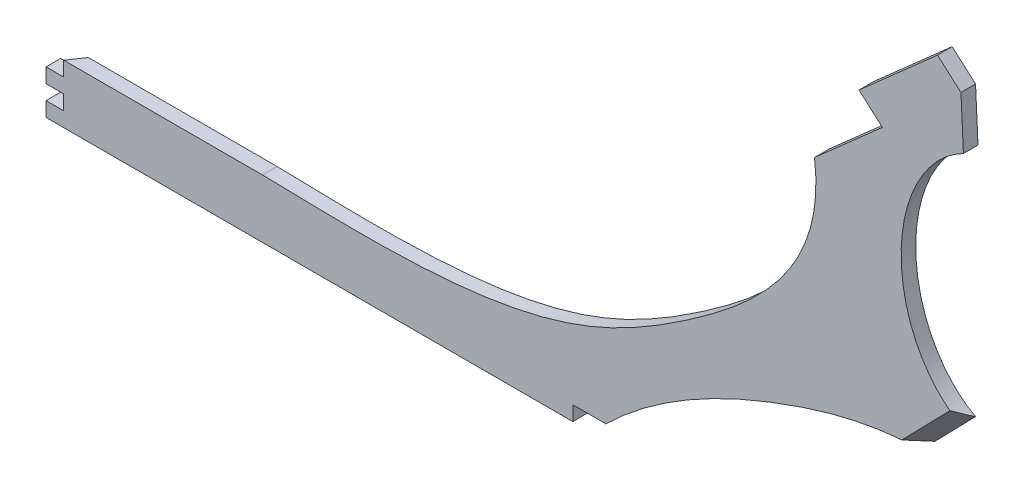
ISO-10303-21;
HEADER;
FILE_DESCRIPTION(('STEP AP214'),'2;1');
FILE_NAME('part.step','',(''),(''),'','','');
FILE_SCHEMA(('AUTOMOTIVE_DESIGN { 1 0 10303 214 1 1 1 1 }'));
ENDSEC;
DATA;
#1=APPLICATION_CONTEXT('core data for automotive mechanical design processes');
#2=APPLICATION_PROTOCOL_DEFINITION('international standard','automotive_design',2000,#1);
#3=PRODUCT_CONTEXT('',#1,'mechanical');
#4=PRODUCT('Part','Part','',(#3));
#5=PRODUCT_RELATED_PRODUCT_CATEGORY('part','',(#4));
#6=PRODUCT_DEFINITION_FORMATION('','',#4);
#7=PRODUCT_DEFINITION_CONTEXT('part definition',#1,'design');
#8=PRODUCT_DEFINITION('design','',#6,#7);
#9=PRODUCT_DEFINITION_SHAPE('','',#8);
#10=(LENGTH_UNIT() NAMED_UNIT(*) SI_UNIT(.MILLI.,.METRE.));
#11=(NAMED_UNIT(*) PLANE_ANGLE_UNIT() SI_UNIT($,.RADIAN.));
#12=(NAMED_UNIT(*) SI_UNIT($,.STERADIAN.) SOLID_ANGLE_UNIT());
#13=UNCERTAINTY_MEASURE_WITH_UNIT(LENGTH_MEASURE(1.E-05),#10,'distance_accuracy_value','');
#14=(GEOMETRIC_REPRESENTATION_CONTEXT(3) GLOBAL_UNCERTAINTY_ASSIGNED_CONTEXT((#13)) GLOBAL_UNIT_ASSIGNED_CONTEXT((#10,
#11,#12)) REPRESENTATION_CONTEXT('',''));
#15=CARTESIAN_POINT('',(0.,0.,0.));
#16=DIRECTION('',(0.,0.,1.));
#17=DIRECTION('',(1.,0.,0.));
#18=AXIS2_PLACEMENT_3D('',#15,#16,#17);
#19=CARTESIAN_POINT('',(-575.271952130616,-118.031926349393,10.));
#20=DIRECTION('',(1.,0.,0.));
#21=DIRECTION('',(0.,0.,-1.));
#22=AXIS2_PLACEMENT_3D('',#19,#20,#21);
#23=PLANE('',#22);
#24=DIRECTION('',(0.,-1.,0.));
#25=VECTOR('',#24,1.);
#26=CARTESIAN_POINT('',(-575.271952130616,-118.031926349393,10.));
#27=LINE('',#26,#25);
#28=CARTESIAN_POINT('',(-575.271952130616,-148.031926349393,10.));
#29=VERTEX_POINT('',#28);
#30=CARTESIAN_POINT('',(-575.271952130616,-158.031926349393,10.));
#31=VERTEX_POINT('',#30);
#32=EDGE_CURVE('E362',#29,#31,#27,.T.);
#33=ORIENTED_EDGE('',*,*,#32,.F.);
#34=DIRECTION('',(0.,0.,-1.));
#35=VECTOR('',#34,1.);
#36=CARTESIAN_POINT('',(-575.271952130616,-148.031926349393,10.));
#37=LINE('',#36,#35);
#38=CARTESIAN_POINT('',(-575.271952130616,-148.031926349393,0.));
#39=VERTEX_POINT('',#38);
#40=EDGE_CURVE('E11',#29,#39,#37,.T.);
#41=ORIENTED_EDGE('',*,*,#40,.T.);
#42=DIRECTION('',(0.,-1.,0.));
#43=VECTOR('',#42,1.);
#44=CARTESIAN_POINT('',(-575.271952130616,-118.031926349393,0.));
#45=LINE('',#44,#43);
#46=CARTESIAN_POINT('',(-575.271952130616,-158.031926349393,0.));
#47=VERTEX_POINT('',#46);
#48=EDGE_CURVE('E339',#39,#47,#45,.T.);
#49=ORIENTED_EDGE('',*,*,#48,.T.);
#50=DIRECTION('',(0.,0.,-1.));
#51=VECTOR('',#50,1.);
#52=CARTESIAN_POINT('',(-575.271952130616,-158.031926349393,10.));
#53=LINE('',#52,#51);
#54=EDGE_CURVE('E308',#31,#47,#53,.T.);
#55=ORIENTED_EDGE('',*,*,#54,.F.);
#56=EDGE_LOOP('',(#33,#41,#49,#55));
#57=FACE_BOUND('',#56,.T.);
#58=ADVANCED_FACE('F32',(#57),#23,.F.);
#59=CARTESIAN_POINT('',(-192.080048862351,-148.031926349393,10.));
#60=CARTESIAN_POINT('',(-157.83700898392,-114.518844889762,10.));
#61=CARTESIAN_POINT('',(-75.1684754251868,-70.6098253840643,10.));
#62=CARTESIAN_POINT('',(16.2410978910054,-49.9389353274737,10.));
#63=CARTESIAN_POINT('',(61.8185418160024,-59.5684170689204,10.));
#64=B_SPLINE_CURVE_WITH_KNOTS('',3,(#59,#60,#61,#62,#63),.UNSPECIFIED.,.F.,.F.,(4,1,4),(0.,
0.513639288530766,1.),.UNSPECIFIED.);
#65=DIRECTION('',(0.,0.,-1.));
#66=VECTOR('',#65,1.);
#67=SURFACE_OF_LINEAR_EXTRUSION('',#64,#66);
#68=CARTESIAN_POINT('',(10.4522064024743,-56.3350215880842,10.0000000000024));
#69=CARTESIAN_POINT('',(12.5898375378794,-56.1782611863151,8.36783221015587));
#70=CARTESIAN_POINT('',(14.7152933126584,-56.0555617975965,6.71841498189915));
#71=CARTESIAN_POINT('',(18.9418541409639,-55.8782850462602,3.38508164856541));
#72=CARTESIAN_POINT('',(21.0429591944905,-55.8237076836426,1.70116554348838));
#73=CARTESIAN_POINT('',(23.131888887391,-55.8031913340754,1.19348975147204E-12));
#74=B_SPLINE_CURVE_WITH_KNOTS('',3,(#68,#69,#70,#71,#72,#73),.UNSPECIFIED.,.F.,.F.,(4,2,4),(0.,
8.07952667243744,16.1590533448749),.UNSPECIFIED.);
#75=CARTESIAN_POINT('',(10.4522064024743,-56.3350215880842,10.0000000000024));
#76=VERTEX_POINT('',#75);
#77=CARTESIAN_POINT('',(23.1318888873908,-55.8031913340754,0.));
#78=VERTEX_POINT('',#77);
#79=EDGE_CURVE('E278',#76,#78,#74,.T.);
#80=ORIENTED_EDGE('',*,*,#79,.F.);
#81=CARTESIAN_POINT('',(-192.080048862351,-148.031926349393,10.));
#82=VERTEX_POINT('',#81);
#83=EDGE_CURVE('E285',#82,#76,#64,.T.);
#84=ORIENTED_EDGE('',*,*,#83,.F.);
#85=DIRECTION('',(0.,0.,-1.));
#86=VECTOR('',#85,1.);
#87=CARTESIAN_POINT('',(-192.080048862351,-148.031926349393,10.));
#88=LINE('',#87,#86);
#89=CARTESIAN_POINT('',(-192.080048862351,-148.031926349393,0.));
#90=VERTEX_POINT('',#89);
#91=EDGE_CURVE('E187',#82,#90,#88,.T.);
#92=ORIENTED_EDGE('',*,*,#91,.T.);
#93=CARTESIAN_POINT('',(-192.080048862351,-148.031926349393,0.));
#94=CARTESIAN_POINT('',(-157.83700898392,-114.518844889762,0.));
#95=CARTESIAN_POINT('',(-75.1684754251868,-70.6098253840643,0.));
#96=CARTESIAN_POINT('',(16.2410978910054,-49.9389353274737,0.));
#97=CARTESIAN_POINT('',(61.8185418160024,-59.5684170689204,0.));
#98=B_SPLINE_CURVE_WITH_KNOTS('',3,(#93,#94,#95,#96,#97),.UNSPECIFIED.,.F.,.F.,(4,1,4),(0.,
0.513639288530766,1.),.UNSPECIFIED.);
#99=EDGE_CURVE('E264',#90,#78,#98,.T.);
#100=ORIENTED_EDGE('',*,*,#99,.T.);
#101=EDGE_LOOP('',(#80,#84,#92,#100));
#102=FACE_BOUND('',#101,.T.);
#103=ADVANCED_FACE('F34',(#102),#67,.F.);
#104=CARTESIAN_POINT('',(50.9302948183221,169.898138866862,10.));
#105=DIRECTION('',(-0.998876134021714,-0.0473969290337899,0.));
#106=DIRECTION('',(0.0473969290337899,-0.998876134021714,0.));
#107=AXIS2_PLACEMENT_3D('',#104,#105,#106);
#108=PLANE('',#107);
#109=DIRECTION('',(-0.0473969290337899,0.998876134021714,0.));
#110=VECTOR('',#109,1.);
#111=CARTESIAN_POINT('',(50.9302948183221,169.898138866862,10.));
#112=LINE('',#111,#110);
#113=CARTESIAN_POINT('',(52.6080237171103,134.54050303431,10.));
#114=VERTEX_POINT('',#113);
#115=CARTESIAN_POINT('',(50.9302948183221,169.898138866862,10.));
#116=VERTEX_POINT('',#115);
#117=EDGE_CURVE('E291',#114,#116,#112,.T.);
#118=ORIENTED_EDGE('',*,*,#117,.F.);
#119=DIRECTION('',(0.,0.,1.));
#120=VECTOR('',#119,1.);
#121=CARTESIAN_POINT('',(52.6080237171103,134.54050303431,0.));
#122=LINE('',#121,#120);
#123=CARTESIAN_POINT('',(52.6080237171103,134.54050303431,0.));
#124=VERTEX_POINT('',#123);
#125=EDGE_CURVE('E239',#114,#124,#122,.F.);
#126=ORIENTED_EDGE('',*,*,#125,.T.);
#127=DIRECTION('',(-0.0473969290337899,0.998876134021714,0.));
#128=VECTOR('',#127,1.);
#129=CARTESIAN_POINT('',(50.9302948183221,169.898138866862,0.));
#130=LINE('',#129,#128);
#131=CARTESIAN_POINT('',(50.9302948183221,169.898138866862,0.));
#132=VERTEX_POINT('',#131);
#133=EDGE_CURVE('E290',#124,#132,#130,.T.);
#134=ORIENTED_EDGE('',*,*,#133,.T.);
#135=DIRECTION('',(0.,0.,-1.));
#136=VECTOR('',#135,1.);
#137=CARTESIAN_POINT('',(50.9302948183221,169.898138866862,10.));
#138=LINE('',#137,#136);
#139=EDGE_CURVE('E310',#116,#132,#138,.T.);
#140=ORIENTED_EDGE('',*,*,#139,.F.);
#141=EDGE_LOOP('',(#118,#126,#134,#140));
#142=FACE_BOUND('',#141,.T.);
#143=ADVANCED_FACE('F391',(#142),#108,.F.);
#144=CARTESIAN_POINT('',(-192.957564545317,-91.4048145856407,10.));
#145=DIRECTION('',(0.,0.,1.));
#146=DIRECTION('',(1.,0.,0.));
#147=AXIS2_PLACEMENT_3D('',#144,#145,#146);
#148=PLANE('',#147);
#149=DIRECTION('',(0.,-1.,0.));
#150=VECTOR('',#149,1.);
#151=CARTESIAN_POINT('',(-214.703789377147,-148.031926349393,10.));
#152=LINE('',#151,#150);
#153=CARTESIAN_POINT('',(-214.703789377147,-148.031926349393,10.));
#154=VERTEX_POINT('',#153);
#155=CARTESIAN_POINT('',(-214.703789377147,-158.031926349393,10.));
#156=VERTEX_POINT('',#155);
#157=EDGE_CURVE('E175',#154,#156,#152,.T.);
#158=ORIENTED_EDGE('',*,*,#157,.F.);
#159=DIRECTION('',(-1.,0.,0.));
#160=VECTOR('',#159,1.);
#161=CARTESIAN_POINT('',(-192.080048862351,-148.031926349393,10.));
#162=LINE('',#161,#160);
#163=EDGE_CURVE('E182',#82,#154,#162,.T.);
#164=ORIENTED_EDGE('',*,*,#163,.F.);
#165=ORIENTED_EDGE('',*,*,#83,.T.);
#166=DIRECTION('',(0.697503039527459,0.716581823555382,0.));
#167=VECTOR('',#166,1.);
#168=CARTESIAN_POINT('',(-106.037294759092,-176.010857300529,10.));
#169=LINE('',#168,#167);
#170=CARTESIAN_POINT('',(43.412072470478,-22.4736050885302,10.));
#171=VERTEX_POINT('',#170);
#172=EDGE_CURVE('E284',#76,#171,#169,.T.);
#173=ORIENTED_EDGE('',*,*,#172,.T.);
#174=CARTESIAN_POINT('',(76.445934184595,53.1674881884685,10.));
#175=DIRECTION('',(0.,0.,1.));
#176=DIRECTION('',(0.,-1.,0.));
#177=AXIS2_PLACEMENT_3D('',#174,#175,#176);
#178=ELLIPSE('',#177,87.1747624692816,66.4535254185836);
#179=EDGE_CURVE('E234',#114,#171,#178,.T.);
#180=ORIENTED_EDGE('',*,*,#179,.F.);
#181=ORIENTED_EDGE('',*,*,#117,.T.);
#182=DIRECTION('',(-0.749064254158382,0.662497353309542,0.));
#183=VECTOR('',#182,1.);
#184=CARTESIAN_POINT('',(50.9302948183221,169.898138866862,10.));
#185=LINE('',#184,#183);
#186=CARTESIAN_POINT('',(34.9402410916513,184.040274490593,10.));
#187=VERTEX_POINT('',#186);
#188=EDGE_CURVE('E295',#116,#187,#185,.T.);
#189=ORIENTED_EDGE('',*,*,#188,.T.);
#190=DIRECTION('',(-0.749064254158384,-0.662497353309539,0.));
#191=VECTOR('',#190,1.);
#192=CARTESIAN_POINT('',(34.9402410916513,184.040274490593,10.));
#193=LINE('',#192,#191);
#194=CARTESIAN_POINT('',(-18.8625845957431,136.455265032998,10.));
#195=VERTEX_POINT('',#194);
#196=EDGE_CURVE('E355',#187,#195,#193,.T.);
#197=ORIENTED_EDGE('',*,*,#196,.T.);
#198=DIRECTION('',(0.749064254158386,-0.662497353309537,0.));
#199=VECTOR('',#198,1.);
#200=CARTESIAN_POINT('',(-18.8625845957431,136.455265032998,10.));
#201=LINE('',#200,#199);
#202=CARTESIAN_POINT('',(-2.8725308690723,122.313129409267,10.));
#203=VERTEX_POINT('',#202);
#204=EDGE_CURVE('E353',#195,#203,#201,.T.);
#205=ORIENTED_EDGE('',*,*,#204,.T.);
#206=DIRECTION('',(-0.749064254158383,-0.66249735330954,0.));
#207=VECTOR('',#206,1.);
#208=CARTESIAN_POINT('',(-2.8725308690723,122.313129409267,10.));
#209=LINE('',#208,#207);
#210=CARTESIAN_POINT('',(-49.2705355030989,81.2771901046705,10.));
#211=VERTEX_POINT('',#210);
#212=EDGE_CURVE('E347',#203,#211,#209,.T.);
#213=ORIENTED_EDGE('',*,*,#212,.T.);
#214=CARTESIAN_POINT('',(-49.2705355030988,81.2771901046705,10.));
#215=CARTESIAN_POINT('',(-41.0571545855861,17.2026348476018,10.));
#216=CARTESIAN_POINT('',(-108.651854921098,-44.255191332768,10.));
#217=CARTESIAN_POINT('',(-244.870528991534,-125.219604065018,10.));
#218=CARTESIAN_POINT('',(-356.640288990154,-119.331018895481,10.));
#219=CARTESIAN_POINT('',(-427.107921318519,-118.031926349393,10.));
#220=B_SPLINE_CURVE_WITH_KNOTS('',3,(#214,#215,#216,#217,#218,#219),.UNSPECIFIED.,.F.,.F.,(4,1,
1,4),(0.,0.356407170334646,0.531921689294259,1.),.UNSPECIFIED.);
#221=CARTESIAN_POINT('',(-427.107921318519,-118.031926349393,10.));
#222=VERTEX_POINT('',#221);
#223=EDGE_CURVE('E352',#211,#222,#220,.T.);
#224=ORIENTED_EDGE('',*,*,#223,.T.);
#225=DIRECTION('',(-1.,0.,0.));
#226=VECTOR('',#225,1.);
#227=CARTESIAN_POINT('',(-427.107921318519,-118.031926349393,10.));
#228=LINE('',#227,#226);
#229=CARTESIAN_POINT('',(-563.157657035974,-118.031926349393,9.99999999999998));
#230=VERTEX_POINT('',#229);
#231=EDGE_CURVE('E363',#222,#230,#228,.T.);
#232=ORIENTED_EDGE('',*,*,#231,.T.);
#233=DIRECTION('',(0.,1.,0.));
#234=VECTOR('',#233,1.);
#235=CARTESIAN_POINT('',(-563.157657035974,-91.4048145856407,10.));
#236=LINE('',#235,#234);
#237=CARTESIAN_POINT('',(-563.157657035974,-128.031926349393,9.99999999999997));
#238=VERTEX_POINT('',#237);
#239=EDGE_CURVE('E232',#238,#230,#236,.T.);
#240=ORIENTED_EDGE('',*,*,#239,.F.);
#241=DIRECTION('',(1.,0.,0.));
#242=VECTOR('',#241,1.);
#243=CARTESIAN_POINT('',(-192.957564545317,-128.031926349393,10.));
#244=LINE('',#243,#242);
#245=CARTESIAN_POINT('',(-575.271952130616,-128.031926349393,10.));
#246=VERTEX_POINT('',#245);
#247=EDGE_CURVE('E230',#246,#238,#244,.T.);
#248=ORIENTED_EDGE('',*,*,#247,.F.);
#249=CARTESIAN_POINT('',(-575.271952130616,-138.031926349393,10.));
#250=VERTEX_POINT('',#249);
#251=EDGE_CURVE('E359',#246,#250,#27,.T.);
#252=ORIENTED_EDGE('',*,*,#251,.T.);
#253=DIRECTION('',(-1.,0.,0.));
#254=VECTOR('',#253,1.);
#255=CARTESIAN_POINT('',(-192.957564545317,-138.031926349393,10.));
#256=LINE('',#255,#254);
#257=CARTESIAN_POINT('',(-563.157657035974,-138.031926349393,10.));
#258=VERTEX_POINT('',#257);
#259=EDGE_CURVE('E49',#258,#250,#256,.T.);
#260=ORIENTED_EDGE('',*,*,#259,.F.);
#261=DIRECTION('',(0.,-1.,0.));
#262=VECTOR('',#261,1.);
#263=CARTESIAN_POINT('',(-563.157657035974,-91.4048145856407,10.));
#264=LINE('',#263,#262);
#265=CARTESIAN_POINT('',(-563.157657035974,-148.031926349393,10.));
#266=VERTEX_POINT('',#265);
#267=EDGE_CURVE('E218',#258,#266,#264,.T.);
#268=ORIENTED_EDGE('',*,*,#267,.T.);
#269=DIRECTION('',(1.,0.,0.));
#270=VECTOR('',#269,1.);
#271=CARTESIAN_POINT('',(-192.957564545317,-148.031926349393,10.));
#272=LINE('',#271,#270);
#273=EDGE_CURVE('E216',#29,#266,#272,.T.);
#274=ORIENTED_EDGE('',*,*,#273,.F.);
#275=ORIENTED_EDGE('',*,*,#32,.T.);
#276=DIRECTION('',(1.,0.,0.));
#277=VECTOR('',#276,1.);
#278=CARTESIAN_POINT('',(-575.271952130616,-158.031926349393,10.));
#279=LINE('',#278,#277);
#280=EDGE_CURVE('E196',#31,#156,#279,.T.);
#281=ORIENTED_EDGE('',*,*,#280,.T.);
#282=EDGE_LOOP('',(#158,#164,#165,#173,#180,#181,#189,#197,#205,#213,#224,#232,#240,#248,#252,
#260,#268,#274,#275,#281));
#283=FACE_BOUND('',#282,.T.);
#284=ADVANCED_FACE('F194',(#283),#148,.T.);
#285=CARTESIAN_POINT('',(-192.957564545317,-91.4048145856407,0.));
#286=DIRECTION('',(0.,0.,1.));
#287=DIRECTION('',(1.,0.,0.));
#288=AXIS2_PLACEMENT_3D('',#285,#286,#287);
#289=PLANE('',#288);
#290=DIRECTION('',(1.,0.,0.));
#291=VECTOR('',#290,1.);
#292=CARTESIAN_POINT('',(-214.703789377147,-148.031926349393,0.));
#293=LINE('',#292,#291);
#294=CARTESIAN_POINT('',(-214.703789377147,-148.031926349393,0.));
#295=VERTEX_POINT('',#294);
#296=EDGE_CURVE('E181',#295,#90,#293,.T.);
#297=ORIENTED_EDGE('',*,*,#296,.F.);
#298=DIRECTION('',(0.,-1.,0.));
#299=VECTOR('',#298,1.);
#300=CARTESIAN_POINT('',(-214.703789377147,-148.031926349393,0.));
#301=LINE('',#300,#299);
#302=CARTESIAN_POINT('',(-214.703789377147,-158.031926349393,0.));
#303=VERTEX_POINT('',#302);
#304=EDGE_CURVE('E178',#295,#303,#301,.T.);
#305=ORIENTED_EDGE('',*,*,#304,.T.);
#306=DIRECTION('',(1.,0.,0.));
#307=VECTOR('',#306,1.);
#308=CARTESIAN_POINT('',(-575.271952130616,-158.031926349393,0.));
#309=LINE('',#308,#307);
#310=EDGE_CURVE('E333',#47,#303,#309,.T.);
#311=ORIENTED_EDGE('',*,*,#310,.F.);
#312=ORIENTED_EDGE('',*,*,#48,.F.);
#313=DIRECTION('',(1.,0.,0.));
#314=VECTOR('',#313,1.);
#315=CARTESIAN_POINT('',(-192.957564545317,-148.031926349393,0.));
#316=LINE('',#315,#314);
#317=CARTESIAN_POINT('',(-556.319810471442,-148.031926349393,-2.22044604925031E-13));
#318=VERTEX_POINT('',#317);
#319=EDGE_CURVE('E213',#39,#318,#316,.T.);
#320=ORIENTED_EDGE('',*,*,#319,.T.);
#321=DIRECTION('',(0.,1.,0.));
#322=VECTOR('',#321,1.);
#323=CARTESIAN_POINT('',(-556.319810471442,-138.031926349393,-2.22044604925031E-13));
#324=LINE('',#323,#322);
#325=CARTESIAN_POINT('',(-556.319810471442,-138.031926349393,-2.22044604925031E-13));
#326=VERTEX_POINT('',#325);
#327=EDGE_CURVE('E198',#318,#326,#324,.T.);
#328=ORIENTED_EDGE('',*,*,#327,.T.);
#329=DIRECTION('',(-1.,0.,0.));
#330=VECTOR('',#329,1.);
#331=CARTESIAN_POINT('',(-192.957564545317,-138.031926349393,0.));
#332=LINE('',#331,#330);
#333=CARTESIAN_POINT('',(-575.271952130616,-138.031926349393,0.));
#334=VERTEX_POINT('',#333);
#335=EDGE_CURVE('E209',#326,#334,#332,.T.);
#336=ORIENTED_EDGE('',*,*,#335,.T.);
#337=CARTESIAN_POINT('',(-575.271952130616,-128.031926349393,0.));
#338=VERTEX_POINT('',#337);
#339=EDGE_CURVE('E336',#338,#334,#45,.T.);
#340=ORIENTED_EDGE('',*,*,#339,.F.);
#341=DIRECTION('',(1.,0.,0.));
#342=VECTOR('',#341,1.);
#343=CARTESIAN_POINT('',(-192.957564545317,-128.031926349393,0.));
#344=LINE('',#343,#342);
#345=CARTESIAN_POINT('',(-556.319810471442,-128.031926349393,-2.22044604925031E-13));
#346=VERTEX_POINT('',#345);
#347=EDGE_CURVE('E57',#338,#346,#344,.T.);
#348=ORIENTED_EDGE('',*,*,#347,.T.);
#349=DIRECTION('',(0.,1.,0.));
#350=VECTOR('',#349,1.);
#351=CARTESIAN_POINT('',(-556.319810471442,-118.031926349393,-2.22044604925031E-13));
#352=LINE('',#351,#350);
#353=CARTESIAN_POINT('',(-556.319810471442,-118.031926349393,-2.22044604925031E-13));
#354=VERTEX_POINT('',#353);
#355=EDGE_CURVE('E226',#346,#354,#352,.T.);
#356=ORIENTED_EDGE('',*,*,#355,.T.);
#357=DIRECTION('',(-1.,0.,0.));
#358=VECTOR('',#357,1.);
#359=CARTESIAN_POINT('',(-427.107921318519,-118.031926349393,0.));
#360=LINE('',#359,#358);
#361=CARTESIAN_POINT('',(-427.107921318519,-118.031926349393,0.));
#362=VERTEX_POINT('',#361);
#363=EDGE_CURVE('E327',#362,#354,#360,.T.);
#364=ORIENTED_EDGE('',*,*,#363,.F.);
#365=CARTESIAN_POINT('',(-49.2705355030988,81.2771901046705,0.));
#366=CARTESIAN_POINT('',(-41.0571545855861,17.2026348476018,0.));
#367=CARTESIAN_POINT('',(-108.651854921098,-44.255191332768,0.));
#368=CARTESIAN_POINT('',(-244.870528991534,-125.219604065018,0.));
#369=CARTESIAN_POINT('',(-356.640288990154,-119.331018895481,0.));
#370=CARTESIAN_POINT('',(-427.107921318519,-118.031926349393,0.));
#371=B_SPLINE_CURVE_WITH_KNOTS('',3,(#365,#366,#367,#368,#369,#370),.UNSPECIFIED.,.F.,.F.,(4,1,
1,4),(0.,0.356407170334646,0.531921689294259,1.),.UNSPECIFIED.);
#372=CARTESIAN_POINT('',(-49.2705355030989,81.2771901046705,0.));
#373=VERTEX_POINT('',#372);
#374=EDGE_CURVE('E328',#373,#362,#371,.T.);
#375=ORIENTED_EDGE('',*,*,#374,.F.);
#376=DIRECTION('',(-0.749064254158383,-0.66249735330954,0.));
#377=VECTOR('',#376,1.);
#378=CARTESIAN_POINT('',(-2.8725308690723,122.313129409267,0.));
#379=LINE('',#378,#377);
#380=CARTESIAN_POINT('',(-2.8725308690723,122.313129409267,0.));
#381=VERTEX_POINT('',#380);
#382=EDGE_CURVE('E321',#381,#373,#379,.T.);
#383=ORIENTED_EDGE('',*,*,#382,.F.);
#384=DIRECTION('',(0.749064254158386,-0.662497353309537,0.));
#385=VECTOR('',#384,1.);
#386=CARTESIAN_POINT('',(-18.8625845957431,136.455265032998,0.));
#387=LINE('',#386,#385);
#388=CARTESIAN_POINT('',(-18.8625845957431,136.455265032998,0.));
#389=VERTEX_POINT('',#388);
#390=EDGE_CURVE('E317',#389,#381,#387,.T.);
#391=ORIENTED_EDGE('',*,*,#390,.F.);
#392=DIRECTION('',(-0.749064254158384,-0.662497353309539,0.));
#393=VECTOR('',#392,1.);
#394=CARTESIAN_POINT('',(34.9402410916513,184.040274490593,0.));
#395=LINE('',#394,#393);
#396=CARTESIAN_POINT('',(34.9402410916513,184.040274490593,0.));
#397=VERTEX_POINT('',#396);
#398=EDGE_CURVE('E312',#397,#389,#395,.T.);
#399=ORIENTED_EDGE('',*,*,#398,.F.);
#400=DIRECTION('',(-0.749064254158382,0.662497353309542,0.));
#401=VECTOR('',#400,1.);
#402=CARTESIAN_POINT('',(50.9302948183221,169.898138866862,0.));
#403=LINE('',#402,#401);
#404=EDGE_CURVE('E313',#132,#397,#403,.T.);
#405=ORIENTED_EDGE('',*,*,#404,.F.);
#406=ORIENTED_EDGE('',*,*,#133,.F.);
#407=CARTESIAN_POINT('',(76.445934184595,53.1674881884685,0.));
#408=DIRECTION('',(0.,0.,1.));
#409=DIRECTION('',(0.,-1.,0.));
#410=AXIS2_PLACEMENT_3D('',#407,#408,#409);
#411=ELLIPSE('',#410,87.1747624692816,66.4535254185836);
#412=CARTESIAN_POINT('',(50.8789377366644,-27.2971781184744,0.));
#413=VERTEX_POINT('',#412);
#414=EDGE_CURVE('E235',#124,#413,#411,.T.);
#415=ORIENTED_EDGE('',*,*,#414,.T.);
#416=DIRECTION('',(0.697503039527459,0.716581823555382,0.));
#417=VECTOR('',#416,1.);
#418=CARTESIAN_POINT('',(-99.7922291487614,-182.089649843216,0.));
#419=LINE('',#418,#417);
#420=EDGE_CURVE('E263',#78,#413,#419,.T.);
#421=ORIENTED_EDGE('',*,*,#420,.F.);
#422=ORIENTED_EDGE('',*,*,#99,.F.);
#423=EDGE_LOOP('',(#297,#305,#311,#312,#320,#328,#336,#340,#348,#356,#364,#375,#383,#391,#399,
#405,#406,#415,#421,#422));
#424=FACE_BOUND('',#423,.T.);
#425=ADVANCED_FACE('F387',(#424),#289,.F.);
#426=DIRECTION('',(0.,0.,-1.));
#427=VECTOR('',#426,1.);
#428=SURFACE_OF_LINEAR_EXTRUSION('',#220,#427);
#429=ORIENTED_EDGE('',*,*,#374,.T.);
#430=DIRECTION('',(0.,0.,-1.));
#431=VECTOR('',#430,1.);
#432=CARTESIAN_POINT('',(-427.107921318519,-118.031926349393,10.));
#433=LINE('',#432,#431);
#434=EDGE_CURVE('E342',#222,#362,#433,.T.);
#435=ORIENTED_EDGE('',*,*,#434,.F.);
#436=ORIENTED_EDGE('',*,*,#223,.F.);
#437=DIRECTION('',(0.,0.,-1.));
#438=VECTOR('',#437,1.);
#439=CARTESIAN_POINT('',(-49.2705355030989,81.2771901046705,10.));
#440=LINE('',#439,#438);
#441=EDGE_CURVE('E324',#211,#373,#440,.T.);
#442=ORIENTED_EDGE('',*,*,#441,.T.);
#443=EDGE_LOOP('',(#429,#435,#436,#442));
#444=FACE_BOUND('',#443,.T.);
#445=ADVANCED_FACE('F251',(#444),#428,.F.);
#446=CARTESIAN_POINT('',(-427.107921318519,-118.031926349393,10.));
#447=DIRECTION('',(0.,-1.,0.));
#448=DIRECTION('',(1.,0.,0.));
#449=AXIS2_PLACEMENT_3D('',#446,#447,#448);
#450=PLANE('',#449);
#451=ORIENTED_EDGE('',*,*,#363,.T.);
#452=DIRECTION('',(-0.564444444444447,0.,0.825471058932898));
#453=VECTOR('',#452,1.);
#454=CARTESIAN_POINT('',(-556.319810471442,-118.031926349393,-2.22044604925031E-13));
#455=LINE('',#454,#453);
#456=EDGE_CURVE('E221',#354,#230,#455,.T.);
#457=ORIENTED_EDGE('',*,*,#456,.T.);
#458=ORIENTED_EDGE('',*,*,#231,.F.);
#459=ORIENTED_EDGE('',*,*,#434,.T.);
#460=EDGE_LOOP('',(#451,#457,#458,#459));
#461=FACE_BOUND('',#460,.T.);
#462=ADVANCED_FACE('F408',(#461),#450,.F.);
#463=ORIENTED_EDGE('',*,*,#339,.T.);
#464=DIRECTION('',(0.,0.,1.));
#465=VECTOR('',#464,1.);
#466=CARTESIAN_POINT('',(-575.271952130616,-138.031926349393,10.));
#467=LINE('',#466,#465);
#468=EDGE_CURVE('E42',#334,#250,#467,.T.);
#469=ORIENTED_EDGE('',*,*,#468,.T.);
#470=ORIENTED_EDGE('',*,*,#251,.F.);
#471=DIRECTION('',(0.,0.,-1.));
#472=VECTOR('',#471,1.);
#473=CARTESIAN_POINT('',(-575.271952130616,-128.031926349393,10.));
#474=LINE('',#473,#472);
#475=EDGE_CURVE('E262',#246,#338,#474,.T.);
#476=ORIENTED_EDGE('',*,*,#475,.T.);
#477=EDGE_LOOP('',(#463,#469,#470,#476));
#478=FACE_BOUND('',#477,.T.);
#479=ADVANCED_FACE('F401',(#478),#23,.F.);
#480=CARTESIAN_POINT('',(-575.271952130616,-158.031926349393,10.));
#481=DIRECTION('',(0.,1.,0.));
#482=DIRECTION('',(0.,0.,1.));
#483=AXIS2_PLACEMENT_3D('',#480,#481,#482);
#484=PLANE('',#483);
#485=ORIENTED_EDGE('',*,*,#310,.T.);
#486=DIRECTION('',(0.,0.,-1.));
#487=VECTOR('',#486,1.);
#488=CARTESIAN_POINT('',(-214.703789377147,-158.031926349393,10.));
#489=LINE('',#488,#487);
#490=EDGE_CURVE('E191',#156,#303,#489,.T.);
#491=ORIENTED_EDGE('',*,*,#490,.F.);
#492=ORIENTED_EDGE('',*,*,#280,.F.);
#493=ORIENTED_EDGE('',*,*,#54,.T.);
#494=EDGE_LOOP('',(#485,#491,#492,#493));
#495=FACE_BOUND('',#494,.T.);
#496=ADVANCED_FACE('F407',(#495),#484,.F.);
#497=CARTESIAN_POINT('',(50.9302948183221,169.898138866862,10.));
#498=DIRECTION('',(-0.662497353309542,-0.749064254158382,0.));
#499=DIRECTION('',(0.749064254158382,-0.662497353309542,0.));
#500=AXIS2_PLACEMENT_3D('',#497,#498,#499);
#501=PLANE('',#500);
#502=ORIENTED_EDGE('',*,*,#404,.T.);
#503=DIRECTION('',(0.,0.,-1.));
#504=VECTOR('',#503,1.);
#505=CARTESIAN_POINT('',(34.9402410916513,184.040274490593,10.));
#506=LINE('',#505,#504);
#507=EDGE_CURVE('E314',#187,#397,#506,.T.);
#508=ORIENTED_EDGE('',*,*,#507,.F.);
#509=ORIENTED_EDGE('',*,*,#188,.F.);
#510=ORIENTED_EDGE('',*,*,#139,.T.);
#511=EDGE_LOOP('',(#502,#508,#509,#510));
#512=FACE_BOUND('',#511,.T.);
#513=ADVANCED_FACE('F414',(#512),#501,.F.);
#514=CARTESIAN_POINT('',(34.9402410916513,184.040274490593,10.));
#515=DIRECTION('',(0.662497353309539,-0.749064254158384,0.));
#516=DIRECTION('',(0.749064254158384,0.662497353309539,0.));
#517=AXIS2_PLACEMENT_3D('',#514,#515,#516);
#518=PLANE('',#517);
#519=ORIENTED_EDGE('',*,*,#398,.T.);
#520=DIRECTION('',(0.,0.,-1.));
#521=VECTOR('',#520,1.);
#522=CARTESIAN_POINT('',(-18.8625845957431,136.455265032998,10.));
#523=LINE('',#522,#521);
#524=EDGE_CURVE('E318',#195,#389,#523,.T.);
#525=ORIENTED_EDGE('',*,*,#524,.F.);
#526=ORIENTED_EDGE('',*,*,#196,.F.);
#527=ORIENTED_EDGE('',*,*,#507,.T.);
#528=EDGE_LOOP('',(#519,#525,#526,#527));
#529=FACE_BOUND('',#528,.T.);
#530=ADVANCED_FACE('F441',(#529),#518,.F.);
#531=CARTESIAN_POINT('',(-18.8625845957431,136.455265032998,10.));
#532=DIRECTION('',(0.662497353309537,0.749064254158386,0.));
#533=DIRECTION('',(-0.749064254158386,0.662497353309537,0.));
#534=AXIS2_PLACEMENT_3D('',#531,#532,#533);
#535=PLANE('',#534);
#536=ORIENTED_EDGE('',*,*,#390,.T.);
#537=DIRECTION('',(0.,0.,-1.));
#538=VECTOR('',#537,1.);
#539=CARTESIAN_POINT('',(-2.8725308690723,122.313129409267,10.));
#540=LINE('',#539,#538);
#541=EDGE_CURVE('E283',#203,#381,#540,.T.);
#542=ORIENTED_EDGE('',*,*,#541,.F.);
#543=ORIENTED_EDGE('',*,*,#204,.F.);
#544=ORIENTED_EDGE('',*,*,#524,.T.);
#545=EDGE_LOOP('',(#536,#542,#543,#544));
#546=FACE_BOUND('',#545,.T.);
#547=ADVANCED_FACE('F437',(#546),#535,.F.);
#548=CARTESIAN_POINT('',(-2.8725308690723,122.313129409267,10.));
#549=DIRECTION('',(0.66249735330954,-0.749064254158383,0.));
#550=DIRECTION('',(0.749064254158383,0.66249735330954,0.));
#551=AXIS2_PLACEMENT_3D('',#548,#549,#550);
#552=PLANE('',#551);
#553=ORIENTED_EDGE('',*,*,#382,.T.);
#554=ORIENTED_EDGE('',*,*,#441,.F.);
#555=ORIENTED_EDGE('',*,*,#212,.F.);
#556=ORIENTED_EDGE('',*,*,#541,.T.);
#557=EDGE_LOOP('',(#553,#554,#555,#556));
#558=FACE_BOUND('',#557,.T.);
#559=ADVANCED_FACE('F272',(#558),#552,.F.);
#560=CARTESIAN_POINT('',(102.70079940259,17.1559429127895,-7.03197143594324));
#561=DIRECTION('',(0.540216679187251,-0.525833566175316,0.65701217660805));
#562=DIRECTION('',(0.772421640643125,0.,-0.635110076338096));
#563=AXIS2_PLACEMENT_3D('',#560,#561,#562);
#564=PLANE('',#563);
#565=CARTESIAN_POINT('',(43.412072470478,-22.4736050885302,10.));
#566=CARTESIAN_POINT('',(43.6476230982867,-22.6506283843345,9.6646437056894));
#567=CARTESIAN_POINT('',(43.8844976553179,-22.8261325063709,9.32941469046897));
#568=CARTESIAN_POINT('',(44.3608229304709,-23.1739840858674,8.6593648640331));
#569=CARTESIAN_POINT('',(44.6002726839714,-23.346332664155,8.32454394891676));
#570=CARTESIAN_POINT('',(45.0817802904344,-23.6878356557518,7.65531407502351));
#571=CARTESIAN_POINT('',(45.3238373985145,-23.8569909452167,7.32090502748998));
#572=CARTESIAN_POINT('',(45.8105936582102,-24.192067098297,6.65250320125879));
#573=CARTESIAN_POINT('',(46.0552922956508,-24.3579885743447,6.31851035517803));
#574=CARTESIAN_POINT('',(46.5473675700134,-24.6865545722351,5.65094540488241));
#575=CARTESIAN_POINT('',(46.7947439354955,-24.849199421533,5.31737326177852));
#576=CARTESIAN_POINT('',(47.2922195205469,-25.1711714389194,4.65064543200574));
#577=CARTESIAN_POINT('',(47.5423187982881,-25.3304985359154,4.31748975440432));
#578=CARTESIAN_POINT('',(48.045272445356,-25.6457817902143,3.65161097385243));
#579=CARTESIAN_POINT('',(48.2981270527096,-25.8017376527551,3.31888791109865));
#580=CARTESIAN_POINT('',(48.8066322341183,-26.1102267560103,2.65388211471197));
#581=CARTESIAN_POINT('',(49.0622833120665,-26.2627593642622,2.32159947294724));
#582=CARTESIAN_POINT('',(49.5764246562835,-26.5643474931234,1.65748257153199));
#583=CARTESIAN_POINT('',(49.834915707967,-26.7134020143274,1.32564846595283));
#584=CARTESIAN_POINT('',(50.3547827210064,-27.0079757184724,0.662437663674008));
#585=CARTESIAN_POINT('',(50.616159766395,-27.1534935023628,0.331061195364658));
#586=CARTESIAN_POINT('',(50.8789377366644,-27.2971781184744,0.));
#587=B_SPLINE_CURVE_WITH_KNOTS('',3,(#565,#566,#567,#568,#569,#570,#571,#572,#573,#574,#575,
#576,#577,#578,#579,#580,#581,#582,#583,#584,#585,#586),.UNSPECIFIED.,.F.,.F.,(4,2,2,2,2,2,2,2,
2,2,4),(0.,1.33923731560207,2.67798933500051,4.01636853423126,5.35449175350114,6.69248057509057,
8.03049803753843,9.3686320194739,10.7070112259905,12.0457703856739,13.3850507805811),.UNSPECIFIED.);
#588=EDGE_CURVE('E255',#171,#413,#587,.T.);
#589=ORIENTED_EDGE('',*,*,#588,.F.);
#590=ORIENTED_EDGE('',*,*,#172,.F.);
#591=ORIENTED_EDGE('',*,*,#79,.T.);
#592=ORIENTED_EDGE('',*,*,#420,.T.);
#593=EDGE_LOOP('',(#589,#590,#591,#592));
#594=FACE_BOUND('',#593,.T.);
#595=ADVANCED_FACE('F248',(#594),#564,.T.);
#596=DIRECTION('',(0.,0.,1.));
#597=VECTOR('',#596,1.);
#598=SURFACE_OF_LINEAR_EXTRUSION('',#411,#597);
#599=ORIENTED_EDGE('',*,*,#179,.T.);
#600=ORIENTED_EDGE('',*,*,#588,.T.);
#601=ORIENTED_EDGE('',*,*,#414,.F.);
#602=ORIENTED_EDGE('',*,*,#125,.F.);
#603=EDGE_LOOP('',(#599,#600,#601,#602));
#604=FACE_BOUND('',#603,.T.);
#605=ADVANCED_FACE('F242',(#604),#598,.F.);
#606=CARTESIAN_POINT('',(-581.083942239429,-128.031926349393,-16.9333333333336));
#607=DIRECTION('',(0.,-1.,0.));
#608=DIRECTION('',(0.,0.,-1.));
#609=AXIS2_PLACEMENT_3D('',#606,#607,#608);
#610=PLANE('',#609);
#611=ORIENTED_EDGE('',*,*,#247,.T.);
#612=DIRECTION('',(0.564444444444447,0.,-0.825471058932898));
#613=VECTOR('',#612,1.);
#614=CARTESIAN_POINT('',(-556.319810471442,-128.031926349393,-2.22044604925031E-13));
#615=LINE('',#614,#613);
#616=EDGE_CURVE('E224',#238,#346,#615,.T.);
#617=ORIENTED_EDGE('',*,*,#616,.T.);
#618=ORIENTED_EDGE('',*,*,#347,.F.);
#619=ORIENTED_EDGE('',*,*,#475,.F.);
#620=EDGE_LOOP('',(#611,#617,#618,#619));
#621=FACE_BOUND('',#620,.T.);
#622=ADVANCED_FACE('F247',(#621),#610,.F.);
#623=CARTESIAN_POINT('',(-571.242940223116,-118.031926349393,21.824312100071));
#624=DIRECTION('',(0.825471058932898,0.,0.564444444444447));
#625=DIRECTION('',(0.564444444444447,0.,-0.825471058932898));
#626=AXIS2_PLACEMENT_3D('',#623,#624,#625);
#627=PLANE('',#626);
#628=ORIENTED_EDGE('',*,*,#239,.T.);
#629=ORIENTED_EDGE('',*,*,#456,.F.);
#630=ORIENTED_EDGE('',*,*,#355,.F.);
#631=ORIENTED_EDGE('',*,*,#616,.F.);
#632=EDGE_LOOP('',(#628,#629,#630,#631));
#633=FACE_BOUND('',#632,.T.);
#634=ADVANCED_FACE('F429',(#633),#627,.F.);
#635=CARTESIAN_POINT('',(-581.083942239429,-148.031926349393,-16.9333333333336));
#636=DIRECTION('',(0.,-1.,0.));
#637=DIRECTION('',(0.,0.,-1.));
#638=AXIS2_PLACEMENT_3D('',#635,#636,#637);
#639=PLANE('',#638);
#640=ORIENTED_EDGE('',*,*,#273,.T.);
#641=DIRECTION('',(0.564444444444447,0.,-0.825471058932898));
#642=VECTOR('',#641,1.);
#643=CARTESIAN_POINT('',(-556.319810471442,-148.031926349393,-2.22044604925031E-13));
#644=LINE('',#643,#642);
#645=EDGE_CURVE('E207',#266,#318,#644,.T.);
#646=ORIENTED_EDGE('',*,*,#645,.T.);
#647=ORIENTED_EDGE('',*,*,#319,.F.);
#648=ORIENTED_EDGE('',*,*,#40,.F.);
#649=EDGE_LOOP('',(#640,#646,#647,#648));
#650=FACE_BOUND('',#649,.T.);
#651=ADVANCED_FACE('F475',(#650),#639,.F.);
#652=CARTESIAN_POINT('',(-581.083942239429,-138.031926349393,-16.9333333333336));
#653=DIRECTION('',(0.,1.,0.));
#654=DIRECTION('',(0.,0.,1.));
#655=AXIS2_PLACEMENT_3D('',#652,#653,#654);
#656=PLANE('',#655);
#657=ORIENTED_EDGE('',*,*,#259,.T.);
#658=ORIENTED_EDGE('',*,*,#468,.F.);
#659=ORIENTED_EDGE('',*,*,#335,.F.);
#660=DIRECTION('',(-0.564444444444447,0.,0.825471058932898));
#661=VECTOR('',#660,1.);
#662=CARTESIAN_POINT('',(-556.319810471442,-138.031926349393,-2.22044604925031E-13));
#663=LINE('',#662,#661);
#664=EDGE_CURVE('E205',#326,#258,#663,.T.);
#665=ORIENTED_EDGE('',*,*,#664,.T.);
#666=EDGE_LOOP('',(#657,#658,#659,#665));
#667=FACE_BOUND('',#666,.T.);
#668=ADVANCED_FACE('F420',(#667),#656,.F.);
#669=CARTESIAN_POINT('',(-556.319810471442,-148.031926349393,-2.22044604925031E-13));
#670=DIRECTION('',(-0.825471058932898,0.,-0.564444444444447));
#671=DIRECTION('',(-0.564444444444447,0.,0.825471058932898));
#672=AXIS2_PLACEMENT_3D('',#669,#670,#671);
#673=PLANE('',#672);
#674=ORIENTED_EDGE('',*,*,#664,.F.);
#675=ORIENTED_EDGE('',*,*,#327,.F.);
#676=ORIENTED_EDGE('',*,*,#645,.F.);
#677=ORIENTED_EDGE('',*,*,#267,.F.);
#678=EDGE_LOOP('',(#674,#675,#676,#677));
#679=FACE_BOUND('',#678,.T.);
#680=ADVANCED_FACE('F422',(#679),#673,.T.);
#681=CARTESIAN_POINT('',(-214.703789377147,-148.031926349393,10.));
#682=DIRECTION('',(-1.,0.,0.));
#683=DIRECTION('',(0.,0.,1.));
#684=AXIS2_PLACEMENT_3D('',#681,#682,#683);
#685=PLANE('',#684);
#686=ORIENTED_EDGE('',*,*,#490,.T.);
#687=ORIENTED_EDGE('',*,*,#304,.F.);
#688=DIRECTION('',(0.,0.,-1.));
#689=VECTOR('',#688,1.);
#690=CARTESIAN_POINT('',(-214.703789377147,-148.031926349393,10.));
#691=LINE('',#690,#689);
#692=EDGE_CURVE('E171',#154,#295,#691,.T.);
#693=ORIENTED_EDGE('',*,*,#692,.F.);
#694=ORIENTED_EDGE('',*,*,#157,.T.);
#695=EDGE_LOOP('',(#686,#687,#693,#694));
#696=FACE_BOUND('',#695,.T.);
#697=ADVANCED_FACE('F173',(#696),#685,.F.);
#698=CARTESIAN_POINT('',(-214.703789377147,-148.031926349393,10.));
#699=DIRECTION('',(0.,-1.,0.));
#700=DIRECTION('',(0.,0.,-1.));
#701=AXIS2_PLACEMENT_3D('',#698,#699,#700);
#702=PLANE('',#701);
#703=ORIENTED_EDGE('',*,*,#163,.T.);
#704=ORIENTED_EDGE('',*,*,#692,.T.);
#705=ORIENTED_EDGE('',*,*,#296,.T.);
#706=ORIENTED_EDGE('',*,*,#91,.F.);
#707=EDGE_LOOP('',(#703,#704,#705,#706));
#708=FACE_BOUND('',#707,.T.);
#709=ADVANCED_FACE('F185',(#708),#702,.T.);
#710=CLOSED_SHELL('',(#58,#103,#143,#284,#425,#445,#462,#479,#496,#513,#530,#547,#559,#595,#605,
#622,#634,#651,#668,#680,#697,#709));
#711=MANIFOLD_SOLID_BREP('B2',#710);
#712=ADVANCED_BREP_SHAPE_REPRESENTATION('',(#18,#711),#14);
#713=SHAPE_DEFINITION_REPRESENTATION(#9,#712);
ENDSEC;
END-ISO-10303-21;
